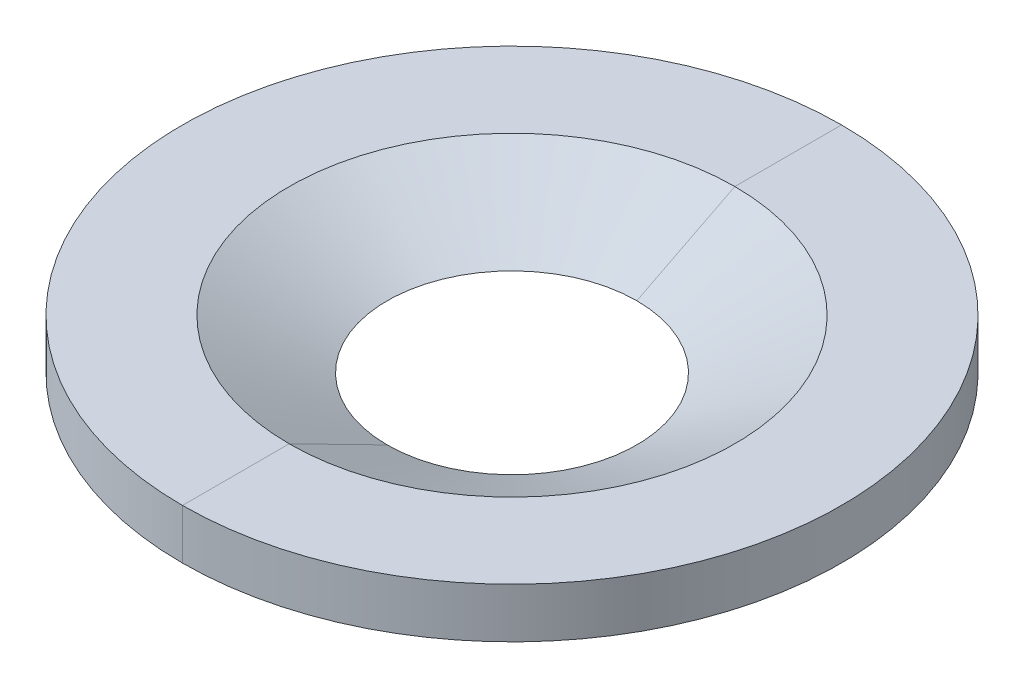
ISO-10303-21;
HEADER;
FILE_DESCRIPTION(('STEP AP214'),'2;1');
FILE_NAME('part.step','',(''),(''),'','','');
FILE_SCHEMA(('AUTOMOTIVE_DESIGN { 1 0 10303 214 1 1 1 1 }'));
ENDSEC;
DATA;
#1=APPLICATION_CONTEXT('core data for automotive mechanical design processes');
#2=APPLICATION_PROTOCOL_DEFINITION('international standard','automotive_design',2000,#1);
#3=PRODUCT_CONTEXT('',#1,'mechanical');
#4=PRODUCT('Part','Part','',(#3));
#5=PRODUCT_RELATED_PRODUCT_CATEGORY('part','',(#4));
#6=PRODUCT_DEFINITION_FORMATION('','',#4);
#7=PRODUCT_DEFINITION_CONTEXT('part definition',#1,'design');
#8=PRODUCT_DEFINITION('design','',#6,#7);
#9=PRODUCT_DEFINITION_SHAPE('','',#8);
#10=(LENGTH_UNIT() NAMED_UNIT(*) SI_UNIT(.MILLI.,.METRE.));
#11=(NAMED_UNIT(*) PLANE_ANGLE_UNIT() SI_UNIT($,.RADIAN.));
#12=(NAMED_UNIT(*) SI_UNIT($,.STERADIAN.) SOLID_ANGLE_UNIT());
#13=UNCERTAINTY_MEASURE_WITH_UNIT(LENGTH_MEASURE(1.E-05),#10,'distance_accuracy_value','');
#14=(GEOMETRIC_REPRESENTATION_CONTEXT(3) GLOBAL_UNCERTAINTY_ASSIGNED_CONTEXT((#13)) GLOBAL_UNIT_ASSIGNED_CONTEXT((#10,
#11,#12)) REPRESENTATION_CONTEXT('',''));
#15=CARTESIAN_POINT('',(0.,0.,0.));
#16=DIRECTION('',(0.,0.,1.));
#17=DIRECTION('',(1.,0.,0.));
#18=AXIS2_PLACEMENT_3D('',#15,#16,#17);
#19=CARTESIAN_POINT('',(0.,0.,0.));
#20=DIRECTION('',(1.,0.,0.));
#21=DIRECTION('',(0.,0.,-1.));
#22=AXIS2_PLACEMENT_3D('',#19,#20,#21);
#23=PLANE('',#22);
#24=DIRECTION('',(0.,0.,-1.));
#25=VECTOR('',#24,1.);
#26=CARTESIAN_POINT('',(0.,-6.35,0.));
#27=LINE('',#26,#25);
#28=CARTESIAN_POINT('',(0.,-6.35,-31.75));
#29=VERTEX_POINT('',#28);
#30=CARTESIAN_POINT('',(0.,-6.35,-83.82));
#31=VERTEX_POINT('',#30);
#32=EDGE_CURVE('E91',#29,#31,#27,.T.);
#33=ORIENTED_EDGE('',*,*,#32,.T.);
#34=DIRECTION('',(0.,-1.,0.));
#35=VECTOR('',#34,1.);
#36=CARTESIAN_POINT('',(0.,6.35,-83.82));
#37=LINE('',#36,#35);
#38=CARTESIAN_POINT('',(0.,6.35,-83.82));
#39=VERTEX_POINT('',#38);
#40=EDGE_CURVE('E108',#31,#39,#37,.F.);
#41=ORIENTED_EDGE('',*,*,#40,.T.);
#42=DIRECTION('',(0.,0.,-1.));
#43=VECTOR('',#42,1.);
#44=CARTESIAN_POINT('',(0.,6.35,0.));
#45=LINE('',#44,#43);
#46=CARTESIAN_POINT('',(0.,6.35,-56.6751534199158));
#47=VERTEX_POINT('',#46);
#48=EDGE_CURVE('E114',#47,#39,#45,.T.);
#49=ORIENTED_EDGE('',*,*,#48,.F.);
#50=DIRECTION('',(0.,0.453990499739541,-0.891006524188371));
#51=VECTOR('',#50,1.);
#52=CARTESIAN_POINT('',(0.,-22.5274330214479,0.));
#53=LINE('',#52,#51);
#54=EDGE_CURVE('E106',#47,#29,#53,.F.);
#55=ORIENTED_EDGE('',*,*,#54,.T.);
#56=EDGE_LOOP('',(#33,#41,#49,#55));
#57=FACE_BOUND('',#56,.T.);
#58=ADVANCED_FACE('F50',(#57),#23,.T.);
#59=CARTESIAN_POINT('',(0.,6.35,83.82));
#60=VERTEX_POINT('',#59);
#61=CARTESIAN_POINT('',(0.,6.35,56.6751534199158));
#62=VERTEX_POINT('',#61);
#63=EDGE_CURVE('E102',#60,#62,#45,.T.);
#64=ORIENTED_EDGE('',*,*,#63,.F.);
#65=DIRECTION('',(0.,-1.,0.));
#66=VECTOR('',#65,1.);
#67=CARTESIAN_POINT('',(0.,6.35,83.82));
#68=LINE('',#67,#66);
#69=CARTESIAN_POINT('',(0.,-6.35,83.82));
#70=VERTEX_POINT('',#69);
#71=EDGE_CURVE('E101',#60,#70,#68,.T.);
#72=ORIENTED_EDGE('',*,*,#71,.T.);
#73=CARTESIAN_POINT('',(0.,-6.35,31.75));
#74=VERTEX_POINT('',#73);
#75=EDGE_CURVE('E89',#70,#74,#27,.T.);
#76=ORIENTED_EDGE('',*,*,#75,.T.);
#77=DIRECTION('',(0.,-0.453990499739541,-0.891006524188371));
#78=VECTOR('',#77,1.);
#79=CARTESIAN_POINT('',(0.,-22.5274330214479,0.));
#80=LINE('',#79,#78);
#81=EDGE_CURVE('E100',#74,#62,#80,.F.);
#82=ORIENTED_EDGE('',*,*,#81,.T.);
#83=EDGE_LOOP('',(#64,#72,#76,#82));
#84=FACE_BOUND('',#83,.T.);
#85=ADVANCED_FACE('F99',(#84),#23,.T.);
#86=CARTESIAN_POINT('',(0.,6.35,0.));
#87=DIRECTION('',(0.,1.,0.));
#88=DIRECTION('',(0.,0.,1.));
#89=AXIS2_PLACEMENT_3D('',#86,#87,#88);
#90=PLANE('',#89);
#91=CARTESIAN_POINT('',(0.,6.35,0.));
#92=DIRECTION('',(0.,1.,0.));
#93=DIRECTION('',(0.,0.,1.));
#94=AXIS2_PLACEMENT_3D('',#91,#92,#93);
#95=CIRCLE('',#94,83.82);
#96=EDGE_CURVE('E112',#39,#60,#95,.T.);
#97=ORIENTED_EDGE('',*,*,#96,.T.);
#98=ORIENTED_EDGE('',*,*,#63,.T.);
#99=CARTESIAN_POINT('',(0.,6.35,0.));
#100=DIRECTION('',(0.,1.,0.));
#101=DIRECTION('',(0.,0.,1.));
#102=AXIS2_PLACEMENT_3D('',#99,#100,#101);
#103=CIRCLE('',#102,56.6751534199158);
#104=EDGE_CURVE('E58',#47,#62,#103,.T.);
#105=ORIENTED_EDGE('',*,*,#104,.F.);
#106=ORIENTED_EDGE('',*,*,#48,.T.);
#107=EDGE_LOOP('',(#97,#98,#105,#106));
#108=FACE_BOUND('',#107,.T.);
#109=ADVANCED_FACE('F127',(#108),#90,.T.);
#110=CARTESIAN_POINT('',(0.,-6.35,0.));
#111=DIRECTION('',(0.,1.,0.));
#112=DIRECTION('',(0.,0.,1.));
#113=AXIS2_PLACEMENT_3D('',#110,#111,#112);
#114=PLANE('',#113);
#115=ORIENTED_EDGE('',*,*,#75,.F.);
#116=CARTESIAN_POINT('',(0.,-6.35,0.));
#117=DIRECTION('',(0.,1.,0.));
#118=DIRECTION('',(0.,0.,1.));
#119=AXIS2_PLACEMENT_3D('',#116,#117,#118);
#120=CIRCLE('',#119,83.82);
#121=EDGE_CURVE('E65',#31,#70,#120,.T.);
#122=ORIENTED_EDGE('',*,*,#121,.F.);
#123=ORIENTED_EDGE('',*,*,#32,.F.);
#124=CARTESIAN_POINT('',(0.,-6.35,0.));
#125=DIRECTION('',(0.,1.,0.));
#126=DIRECTION('',(0.,0.,1.));
#127=AXIS2_PLACEMENT_3D('',#124,#125,#126);
#128=CIRCLE('',#127,31.75);
#129=EDGE_CURVE('E13',#29,#74,#128,.T.);
#130=ORIENTED_EDGE('',*,*,#129,.T.);
#131=EDGE_LOOP('',(#115,#122,#123,#130));
#132=FACE_BOUND('',#131,.T.);
#133=ADVANCED_FACE('F88',(#132),#114,.F.);
#134=CARTESIAN_POINT('',(0.,6.35,0.));
#135=DIRECTION('',(0.,-1.,0.));
#136=DIRECTION('',(0.,0.,-1.));
#137=AXIS2_PLACEMENT_3D('',#134,#135,#136);
#138=CYLINDRICAL_SURFACE('',#137,83.82);
#139=ORIENTED_EDGE('',*,*,#71,.F.);
#140=ORIENTED_EDGE('',*,*,#96,.F.);
#141=ORIENTED_EDGE('',*,*,#40,.F.);
#142=ORIENTED_EDGE('',*,*,#121,.T.);
#143=EDGE_LOOP('',(#139,#140,#141,#142));
#144=FACE_BOUND('',#143,.T.);
#145=ADVANCED_FACE('F52',(#144),#138,.T.);
#146=CARTESIAN_POINT('',(0.,6.35,0.));
#147=DIRECTION('',(0.,1.,0.));
#148=DIRECTION('',(0.,0.,1.));
#149=AXIS2_PLACEMENT_3D('',#146,#147,#148);
#150=CONICAL_SURFACE('',#149,56.6751534199158,1.09955742875643);
#151=ORIENTED_EDGE('',*,*,#54,.F.);
#152=ORIENTED_EDGE('',*,*,#104,.T.);
#153=ORIENTED_EDGE('',*,*,#81,.F.);
#154=ORIENTED_EDGE('',*,*,#129,.F.);
#155=EDGE_LOOP('',(#151,#152,#153,#154));
#156=FACE_BOUND('',#155,.T.);
#157=ADVANCED_FACE('F104',(#156),#150,.F.);
#158=CLOSED_SHELL('',(#58,#85,#109,#133,#145,#157));
#159=MANIFOLD_SOLID_BREP('B2',#158);
#160=CARTESIAN_POINT('',(0.,0.,0.));
#161=DIRECTION('',(1.,0.,0.));
#162=DIRECTION('',(0.,0.,-1.));
#163=AXIS2_PLACEMENT_3D('',#160,#161,#162);
#164=PLANE('',#163);
#165=DIRECTION('',(0.,0.,-1.));
#166=VECTOR('',#165,1.);
#167=CARTESIAN_POINT('',(0.,-6.35,0.));
#168=LINE('',#167,#166);
#169=CARTESIAN_POINT('',(0.,-6.35,-31.75));
#170=VERTEX_POINT('',#169);
#171=CARTESIAN_POINT('',(0.,-6.35,-83.82));
#172=VERTEX_POINT('',#171);
#173=EDGE_CURVE('E222',#170,#172,#168,.T.);
#174=ORIENTED_EDGE('',*,*,#173,.F.);
#175=DIRECTION('',(0.,0.453990499739541,-0.891006524188371));
#176=VECTOR('',#175,1.);
#177=CARTESIAN_POINT('',(0.,-22.5274330214479,0.));
#178=LINE('',#177,#176);
#179=CARTESIAN_POINT('',(0.,6.35,-56.6751534199158));
#180=VERTEX_POINT('',#179);
#181=EDGE_CURVE('E232',#180,#170,#178,.F.);
#182=ORIENTED_EDGE('',*,*,#181,.F.);
#183=DIRECTION('',(0.,0.,-1.));
#184=VECTOR('',#183,1.);
#185=CARTESIAN_POINT('',(0.,6.35,0.));
#186=LINE('',#185,#184);
#187=CARTESIAN_POINT('',(0.,6.35,-83.82));
#188=VERTEX_POINT('',#187);
#189=EDGE_CURVE('E48',#180,#188,#186,.T.);
#190=ORIENTED_EDGE('',*,*,#189,.T.);
#191=DIRECTION('',(0.,-1.,0.));
#192=VECTOR('',#191,1.);
#193=CARTESIAN_POINT('',(0.,6.35,-83.82));
#194=LINE('',#193,#192);
#195=EDGE_CURVE('E174',#172,#188,#194,.F.);
#196=ORIENTED_EDGE('',*,*,#195,.F.);
#197=EDGE_LOOP('',(#174,#182,#190,#196));
#198=FACE_BOUND('',#197,.T.);
#199=ADVANCED_FACE('F171',(#198),#164,.F.);
#200=CARTESIAN_POINT('',(0.,6.35,83.82));
#201=VERTEX_POINT('',#200);
#202=CARTESIAN_POINT('',(0.,6.35,56.6751534199158));
#203=VERTEX_POINT('',#202);
#204=EDGE_CURVE('E180',#201,#203,#186,.T.);
#205=ORIENTED_EDGE('',*,*,#204,.T.);
#206=DIRECTION('',(0.,-0.453990499739541,-0.891006524188371));
#207=VECTOR('',#206,1.);
#208=CARTESIAN_POINT('',(0.,-22.5274330214479,0.));
#209=LINE('',#208,#207);
#210=CARTESIAN_POINT('',(0.,-6.35,31.75));
#211=VERTEX_POINT('',#210);
#212=EDGE_CURVE('E225',#211,#203,#209,.F.);
#213=ORIENTED_EDGE('',*,*,#212,.F.);
#214=CARTESIAN_POINT('',(0.,-6.35,83.82));
#215=VERTEX_POINT('',#214);
#216=EDGE_CURVE('E214',#215,#211,#168,.T.);
#217=ORIENTED_EDGE('',*,*,#216,.F.);
#218=DIRECTION('',(0.,-1.,0.));
#219=VECTOR('',#218,1.);
#220=CARTESIAN_POINT('',(0.,6.35,83.82));
#221=LINE('',#220,#219);
#222=EDGE_CURVE('E194',#201,#215,#221,.T.);
#223=ORIENTED_EDGE('',*,*,#222,.F.);
#224=EDGE_LOOP('',(#205,#213,#217,#223));
#225=FACE_BOUND('',#224,.T.);
#226=ADVANCED_FACE('F226',(#225),#164,.F.);
#227=CARTESIAN_POINT('',(0.,-6.35,0.));
#228=DIRECTION('',(0.,1.,0.));
#229=DIRECTION('',(0.,0.,1.));
#230=AXIS2_PLACEMENT_3D('',#227,#228,#229);
#231=PLANE('',#230);
#232=CARTESIAN_POINT('',(0.,-6.35,0.));
#233=DIRECTION('',(0.,1.,0.));
#234=DIRECTION('',(0.,0.,1.));
#235=AXIS2_PLACEMENT_3D('',#232,#233,#234);
#236=CIRCLE('',#235,83.82);
#237=EDGE_CURVE('E219',#215,#172,#236,.T.);
#238=ORIENTED_EDGE('',*,*,#237,.F.);
#239=ORIENTED_EDGE('',*,*,#216,.T.);
#240=CARTESIAN_POINT('',(0.,-6.35,0.));
#241=DIRECTION('',(0.,1.,0.));
#242=DIRECTION('',(0.,0.,1.));
#243=AXIS2_PLACEMENT_3D('',#240,#241,#242);
#244=CIRCLE('',#243,31.75);
#245=EDGE_CURVE('E218',#211,#170,#244,.T.);
#246=ORIENTED_EDGE('',*,*,#245,.T.);
#247=ORIENTED_EDGE('',*,*,#173,.T.);
#248=EDGE_LOOP('',(#238,#239,#246,#247));
#249=FACE_BOUND('',#248,.T.);
#250=ADVANCED_FACE('F216',(#249),#231,.F.);
#251=CARTESIAN_POINT('',(0.,6.35,0.));
#252=DIRECTION('',(0.,1.,0.));
#253=DIRECTION('',(0.,0.,1.));
#254=AXIS2_PLACEMENT_3D('',#251,#252,#253);
#255=PLANE('',#254);
#256=ORIENTED_EDGE('',*,*,#204,.F.);
#257=CARTESIAN_POINT('',(0.,6.35,0.));
#258=DIRECTION('',(0.,1.,0.));
#259=DIRECTION('',(0.,0.,1.));
#260=AXIS2_PLACEMENT_3D('',#257,#258,#259);
#261=CIRCLE('',#260,83.82);
#262=EDGE_CURVE('E233',#201,#188,#261,.T.);
#263=ORIENTED_EDGE('',*,*,#262,.T.);
#264=ORIENTED_EDGE('',*,*,#189,.F.);
#265=CARTESIAN_POINT('',(0.,6.35,0.));
#266=DIRECTION('',(0.,1.,0.));
#267=DIRECTION('',(0.,0.,1.));
#268=AXIS2_PLACEMENT_3D('',#265,#266,#267);
#269=CIRCLE('',#268,56.6751534199158);
#270=EDGE_CURVE('E238',#203,#180,#269,.T.);
#271=ORIENTED_EDGE('',*,*,#270,.F.);
#272=EDGE_LOOP('',(#256,#263,#264,#271));
#273=FACE_BOUND('',#272,.T.);
#274=ADVANCED_FACE('F254',(#273),#255,.T.);
#275=CARTESIAN_POINT('',(0.,6.35,0.));
#276=DIRECTION('',(0.,1.,0.));
#277=DIRECTION('',(0.,0.,1.));
#278=AXIS2_PLACEMENT_3D('',#275,#276,#277);
#279=CONICAL_SURFACE('',#278,56.6751534199158,1.09955742875643);
#280=ORIENTED_EDGE('',*,*,#270,.T.);
#281=ORIENTED_EDGE('',*,*,#181,.T.);
#282=ORIENTED_EDGE('',*,*,#245,.F.);
#283=ORIENTED_EDGE('',*,*,#212,.T.);
#284=EDGE_LOOP('',(#280,#281,#282,#283));
#285=FACE_BOUND('',#284,.T.);
#286=ADVANCED_FACE('F235',(#285),#279,.F.);
#287=CARTESIAN_POINT('',(0.,6.35,0.));
#288=DIRECTION('',(0.,-1.,0.));
#289=DIRECTION('',(0.,0.,-1.));
#290=AXIS2_PLACEMENT_3D('',#287,#288,#289);
#291=CYLINDRICAL_SURFACE('',#290,83.82);
#292=ORIENTED_EDGE('',*,*,#262,.F.);
#293=ORIENTED_EDGE('',*,*,#222,.T.);
#294=ORIENTED_EDGE('',*,*,#237,.T.);
#295=ORIENTED_EDGE('',*,*,#195,.T.);
#296=EDGE_LOOP('',(#292,#293,#294,#295));
#297=FACE_BOUND('',#296,.T.);
#298=ADVANCED_FACE('F252',(#297),#291,.T.);
#299=CLOSED_SHELL('',(#199,#226,#250,#274,#286,#298));
#300=MANIFOLD_SOLID_BREP('B7',#299);
#301=ADVANCED_BREP_SHAPE_REPRESENTATION('',(#18,#159,#300),#14);
#302=SHAPE_DEFINITION_REPRESENTATION(#9,#301);
ENDSEC;
END-ISO-10303-21;
